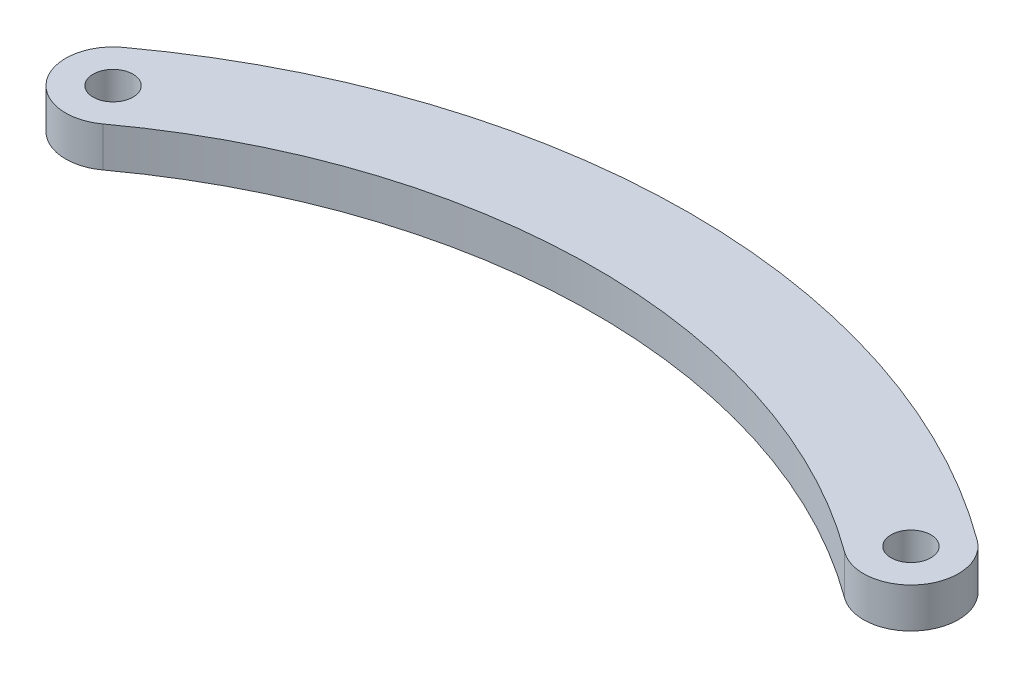
ISO-10303-21;
HEADER;
FILE_DESCRIPTION(('STEP AP214'),'2;1');
FILE_NAME('part.step','',(''),(''),'','','');
FILE_SCHEMA(('AUTOMOTIVE_DESIGN { 1 0 10303 214 1 1 1 1 }'));
ENDSEC;
DATA;
#1=APPLICATION_CONTEXT('core data for automotive mechanical design processes');
#2=APPLICATION_PROTOCOL_DEFINITION('international standard','automotive_design',2000,#1);
#3=PRODUCT_CONTEXT('',#1,'mechanical');
#4=PRODUCT('Part','Part','',(#3));
#5=PRODUCT_RELATED_PRODUCT_CATEGORY('part','',(#4));
#6=PRODUCT_DEFINITION_FORMATION('','',#4);
#7=PRODUCT_DEFINITION_CONTEXT('part definition',#1,'design');
#8=PRODUCT_DEFINITION('design','',#6,#7);
#9=PRODUCT_DEFINITION_SHAPE('','',#8);
#10=(LENGTH_UNIT() NAMED_UNIT(*) SI_UNIT(.MILLI.,.METRE.));
#11=(NAMED_UNIT(*) PLANE_ANGLE_UNIT() SI_UNIT($,.RADIAN.));
#12=(NAMED_UNIT(*) SI_UNIT($,.STERADIAN.) SOLID_ANGLE_UNIT());
#13=UNCERTAINTY_MEASURE_WITH_UNIT(LENGTH_MEASURE(1.E-05),#10,'distance_accuracy_value','');
#14=(GEOMETRIC_REPRESENTATION_CONTEXT(3) GLOBAL_UNCERTAINTY_ASSIGNED_CONTEXT((#13)) GLOBAL_UNIT_ASSIGNED_CONTEXT((#10,
#11,#12)) REPRESENTATION_CONTEXT('',''));
#15=CARTESIAN_POINT('',(0.,0.,0.));
#16=DIRECTION('',(0.,0.,1.));
#17=DIRECTION('',(1.,0.,0.));
#18=AXIS2_PLACEMENT_3D('',#15,#16,#17);
#19=CARTESIAN_POINT('',(34.1076732673267,3.175,2.20049504950495));
#20=DIRECTION('',(0.,-1.,0.));
#21=DIRECTION('',(0.,0.,-1.));
#22=AXIS2_PLACEMENT_3D('',#19,#20,#21);
#23=CYLINDRICAL_SURFACE('',#22,3.7750753482406);
#24=CARTESIAN_POINT('',(34.1076732673267,0.,2.20049504950495));
#25=DIRECTION('',(0.,1.,0.));
#26=DIRECTION('',(0.,0.,1.));
#27=AXIS2_PLACEMENT_3D('',#24,#25,#26);
#28=CIRCLE('',#27,3.7750753482406);
#29=CARTESIAN_POINT('',(31.875510339847,0.,5.24493958834597));
#30=VERTEX_POINT('',#29);
#31=CARTESIAN_POINT('',(36.3398361948065,0.,-0.843949489336048));
#32=VERTEX_POINT('',#31);
#33=EDGE_CURVE('E96',#30,#32,#28,.T.);
#34=ORIENTED_EDGE('',*,*,#33,.T.);
#35=DIRECTION('',(0.,-1.,0.));
#36=VECTOR('',#35,1.);
#37=CARTESIAN_POINT('',(36.3398361948065,3.175,-0.843949489336048));
#38=LINE('',#37,#36);
#39=CARTESIAN_POINT('',(36.3398361948065,3.175,-0.843949489336048));
#40=VERTEX_POINT('',#39);
#41=EDGE_CURVE('E11',#40,#32,#38,.T.);
#42=ORIENTED_EDGE('',*,*,#41,.F.);
#43=CARTESIAN_POINT('',(34.1076732673267,3.175,2.20049504950495));
#44=DIRECTION('',(0.,1.,0.));
#45=DIRECTION('',(0.,0.,1.));
#46=AXIS2_PLACEMENT_3D('',#43,#44,#45);
#47=CIRCLE('',#46,3.7750753482406);
#48=CARTESIAN_POINT('',(31.875510339847,3.175,5.24493958834597));
#49=VERTEX_POINT('',#48);
#50=EDGE_CURVE('E84',#49,#40,#47,.T.);
#51=ORIENTED_EDGE('',*,*,#50,.F.);
#52=DIRECTION('',(0.,-1.,0.));
#53=VECTOR('',#52,1.);
#54=CARTESIAN_POINT('',(31.875510339847,3.175,5.24493958834597));
#55=LINE('',#54,#53);
#56=EDGE_CURVE('E92',#49,#30,#55,.T.);
#57=ORIENTED_EDGE('',*,*,#56,.T.);
#58=EDGE_LOOP('',(#34,#42,#51,#57));
#59=FACE_BOUND('',#58,.T.);
#60=ADVANCED_FACE('F33',(#59),#23,.T.);
#61=CARTESIAN_POINT('',(2.35767326732675,3.175,45.5042848034804));
#62=DIRECTION('',(0.,-1.,0.));
#63=DIRECTION('',(0.,0.,-1.));
#64=AXIS2_PLACEMENT_3D('',#61,#62,#63);
#65=CYLINDRICAL_SURFACE('',#64,57.4712642917449);
#66=CARTESIAN_POINT('',(2.35767326732675,0.,45.5042848034804));
#67=DIRECTION('',(0.,1.,0.));
#68=DIRECTION('',(0.,0.,1.));
#69=AXIS2_PLACEMENT_3D('',#66,#67,#68);
#70=CIRCLE('',#69,57.4712642917449);
#71=CARTESIAN_POINT('',(-31.624489660153,0.,-0.843949489336075));
#72=VERTEX_POINT('',#71);
#73=EDGE_CURVE('E88',#32,#72,#70,.T.);
#74=ORIENTED_EDGE('',*,*,#73,.T.);
#75=DIRECTION('',(0.,-1.,0.));
#76=VECTOR('',#75,1.);
#77=CARTESIAN_POINT('',(-31.624489660153,3.175,-0.843949489336075));
#78=LINE('',#77,#76);
#79=CARTESIAN_POINT('',(-31.624489660153,3.175,-0.843949489336075));
#80=VERTEX_POINT('',#79);
#81=EDGE_CURVE('E41',#80,#72,#78,.T.);
#82=ORIENTED_EDGE('',*,*,#81,.F.);
#83=CARTESIAN_POINT('',(2.35767326732675,3.175,45.5042848034804));
#84=DIRECTION('',(0.,1.,0.));
#85=DIRECTION('',(0.,0.,1.));
#86=AXIS2_PLACEMENT_3D('',#83,#84,#85);
#87=CIRCLE('',#86,57.4712642917449);
#88=EDGE_CURVE('E79',#40,#80,#87,.T.);
#89=ORIENTED_EDGE('',*,*,#88,.F.);
#90=ORIENTED_EDGE('',*,*,#41,.T.);
#91=EDGE_LOOP('',(#74,#82,#89,#90));
#92=FACE_BOUND('',#91,.T.);
#93=ADVANCED_FACE('F87',(#92),#65,.T.);
#94=CARTESIAN_POINT('',(-29.3923267326733,3.175,2.20049504950495));
#95=DIRECTION('',(0.,-1.,0.));
#96=DIRECTION('',(0.,0.,-1.));
#97=AXIS2_PLACEMENT_3D('',#94,#95,#96);
#98=CYLINDRICAL_SURFACE('',#97,3.7750753482406);
#99=CARTESIAN_POINT('',(-29.3923267326733,0.,2.20049504950495));
#100=DIRECTION('',(0.,1.,0.));
#101=DIRECTION('',(0.,0.,1.));
#102=AXIS2_PLACEMENT_3D('',#99,#100,#101);
#103=CIRCLE('',#102,3.7750753482406);
#104=CARTESIAN_POINT('',(-27.1601638051935,0.,5.24493958834595));
#105=VERTEX_POINT('',#104);
#106=EDGE_CURVE('E66',#72,#105,#103,.T.);
#107=ORIENTED_EDGE('',*,*,#106,.T.);
#108=DIRECTION('',(0.,-1.,0.));
#109=VECTOR('',#108,1.);
#110=CARTESIAN_POINT('',(-27.1601638051935,3.175,5.24493958834595));
#111=LINE('',#110,#109);
#112=CARTESIAN_POINT('',(-27.1601638051935,3.175,5.24493958834595));
#113=VERTEX_POINT('',#112);
#114=EDGE_CURVE('E89',#113,#105,#111,.T.);
#115=ORIENTED_EDGE('',*,*,#114,.F.);
#116=CARTESIAN_POINT('',(-29.3923267326733,3.175,2.20049504950495));
#117=DIRECTION('',(0.,1.,0.));
#118=DIRECTION('',(0.,0.,1.));
#119=AXIS2_PLACEMENT_3D('',#116,#117,#118);
#120=CIRCLE('',#119,3.7750753482406);
#121=EDGE_CURVE('E82',#80,#113,#120,.T.);
#122=ORIENTED_EDGE('',*,*,#121,.F.);
#123=ORIENTED_EDGE('',*,*,#81,.T.);
#124=EDGE_LOOP('',(#107,#115,#122,#123));
#125=FACE_BOUND('',#124,.T.);
#126=ADVANCED_FACE('F90',(#125),#98,.T.);
#127=CARTESIAN_POINT('',(2.35767326732675,3.175,45.5042848034804));
#128=DIRECTION('',(0.,-1.,0.));
#129=DIRECTION('',(0.,0.,-1.));
#130=AXIS2_PLACEMENT_3D('',#127,#128,#129);
#131=CYLINDRICAL_SURFACE('',#130,49.9211135952637);
#132=CARTESIAN_POINT('',(2.35767326732675,0.,45.5042848034804));
#133=DIRECTION('',(0.,-1.,0.));
#134=DIRECTION('',(0.,0.,1.));
#135=AXIS2_PLACEMENT_3D('',#132,#133,#134);
#136=CIRCLE('',#135,49.9211135952637);
#137=EDGE_CURVE('E72',#105,#30,#136,.T.);
#138=ORIENTED_EDGE('',*,*,#137,.T.);
#139=ORIENTED_EDGE('',*,*,#56,.F.);
#140=CARTESIAN_POINT('',(2.35767326732675,3.175,45.5042848034804));
#141=DIRECTION('',(0.,-1.,0.));
#142=DIRECTION('',(0.,0.,1.));
#143=AXIS2_PLACEMENT_3D('',#140,#141,#142);
#144=CIRCLE('',#143,49.9211135952637);
#145=EDGE_CURVE('E49',#113,#49,#144,.T.);
#146=ORIENTED_EDGE('',*,*,#145,.F.);
#147=ORIENTED_EDGE('',*,*,#114,.T.);
#148=EDGE_LOOP('',(#138,#139,#146,#147));
#149=FACE_BOUND('',#148,.T.);
#150=ADVANCED_FACE('F104',(#149),#131,.F.);
#151=CARTESIAN_POINT('',(18.2326732673267,3.175,23.8523899264927));
#152=DIRECTION('',(0.,1.,0.));
#153=DIRECTION('',(0.,0.,1.));
#154=AXIS2_PLACEMENT_3D('',#151,#152,#153);
#155=PLANE('',#154);
#156=CARTESIAN_POINT('',(34.1076732673267,3.175,2.20049504950495));
#157=DIRECTION('',(0.,1.,0.));
#158=DIRECTION('',(0.,0.,1.));
#159=AXIS2_PLACEMENT_3D('',#156,#157,#158);
#160=CIRCLE('',#159,1.5875);
#161=CARTESIAN_POINT('',(34.1076732673267,3.175,3.78799504950495));
#162=VERTEX_POINT('',#161);
#163=EDGE_CURVE('E116',#162,#162,#160,.T.);
#164=ORIENTED_EDGE('',*,*,#163,.F.);
#165=EDGE_LOOP('',(#164));
#166=FACE_BOUND('',#165,.T.);
#167=CARTESIAN_POINT('',(-29.3923267326733,3.175,2.20049504950495));
#168=DIRECTION('',(0.,1.,0.));
#169=DIRECTION('',(0.,0.,1.));
#170=AXIS2_PLACEMENT_3D('',#167,#168,#169);
#171=CIRCLE('',#170,1.5875);
#172=CARTESIAN_POINT('',(-29.3923267326733,3.175,3.78799504950494));
#173=VERTEX_POINT('',#172);
#174=EDGE_CURVE('E110',#173,#173,#171,.T.);
#175=ORIENTED_EDGE('',*,*,#174,.F.);
#176=EDGE_LOOP('',(#175));
#177=FACE_BOUND('',#176,.T.);
#178=ORIENTED_EDGE('',*,*,#50,.T.);
#179=ORIENTED_EDGE('',*,*,#88,.T.);
#180=ORIENTED_EDGE('',*,*,#121,.T.);
#181=ORIENTED_EDGE('',*,*,#145,.T.);
#182=EDGE_LOOP('',(#178,#179,#180,#181));
#183=FACE_BOUND('',#182,.T.);
#184=ADVANCED_FACE('F80',(#166,#177,#183),#155,.T.);
#185=CARTESIAN_POINT('',(18.2326732673267,0.,23.8523899264927));
#186=DIRECTION('',(0.,1.,0.));
#187=DIRECTION('',(0.,0.,1.));
#188=AXIS2_PLACEMENT_3D('',#185,#186,#187);
#189=PLANE('',#188);
#190=CARTESIAN_POINT('',(34.1076732673267,0.,2.20049504950495));
#191=DIRECTION('',(0.,1.,0.));
#192=DIRECTION('',(0.,0.,1.));
#193=AXIS2_PLACEMENT_3D('',#190,#191,#192);
#194=CIRCLE('',#193,1.5875);
#195=CARTESIAN_POINT('',(34.1076732673267,0.,3.78799504950495));
#196=VERTEX_POINT('',#195);
#197=EDGE_CURVE('E113',#196,#196,#194,.T.);
#198=ORIENTED_EDGE('',*,*,#197,.T.);
#199=EDGE_LOOP('',(#198));
#200=FACE_BOUND('',#199,.T.);
#201=CARTESIAN_POINT('',(-29.3923267326733,0.,2.20049504950495));
#202=DIRECTION('',(0.,1.,0.));
#203=DIRECTION('',(0.,0.,1.));
#204=AXIS2_PLACEMENT_3D('',#201,#202,#203);
#205=CIRCLE('',#204,1.5875);
#206=CARTESIAN_POINT('',(-29.3923267326733,0.,3.78799504950494));
#207=VERTEX_POINT('',#206);
#208=EDGE_CURVE('E99',#207,#207,#205,.T.);
#209=ORIENTED_EDGE('',*,*,#208,.T.);
#210=EDGE_LOOP('',(#209));
#211=FACE_BOUND('',#210,.T.);
#212=ORIENTED_EDGE('',*,*,#33,.F.);
#213=ORIENTED_EDGE('',*,*,#137,.F.);
#214=ORIENTED_EDGE('',*,*,#106,.F.);
#215=ORIENTED_EDGE('',*,*,#73,.F.);
#216=EDGE_LOOP('',(#212,#213,#214,#215));
#217=FACE_BOUND('',#216,.T.);
#218=ADVANCED_FACE('F107',(#200,#211,#217),#189,.F.);
#219=CARTESIAN_POINT('',(-29.3923267326733,0.,2.20049504950495));
#220=DIRECTION('',(0.,1.,0.));
#221=DIRECTION('',(0.,0.,1.));
#222=AXIS2_PLACEMENT_3D('',#219,#220,#221);
#223=CYLINDRICAL_SURFACE('',#222,1.5875);
#224=ORIENTED_EDGE('',*,*,#208,.F.);
#225=EDGE_LOOP('',(#224));
#226=FACE_BOUND('',#225,.T.);
#227=ORIENTED_EDGE('',*,*,#174,.T.);
#228=EDGE_LOOP('',(#227));
#229=FACE_BOUND('',#228,.T.);
#230=ADVANCED_FACE('F127',(#226,#229),#223,.F.);
#231=CARTESIAN_POINT('',(34.1076732673267,0.,2.20049504950495));
#232=DIRECTION('',(0.,1.,0.));
#233=DIRECTION('',(0.,0.,1.));
#234=AXIS2_PLACEMENT_3D('',#231,#232,#233);
#235=CYLINDRICAL_SURFACE('',#234,1.5875);
#236=ORIENTED_EDGE('',*,*,#197,.F.);
#237=EDGE_LOOP('',(#236));
#238=FACE_BOUND('',#237,.T.);
#239=ORIENTED_EDGE('',*,*,#163,.T.);
#240=EDGE_LOOP('',(#239));
#241=FACE_BOUND('',#240,.T.);
#242=ADVANCED_FACE('F124',(#238,#241),#235,.F.);
#243=CLOSED_SHELL('',(#60,#93,#126,#150,#184,#218,#230,#242));
#244=MANIFOLD_SOLID_BREP('B2',#243);
#245=ADVANCED_BREP_SHAPE_REPRESENTATION('',(#18,#244),#14);
#246=SHAPE_DEFINITION_REPRESENTATION(#9,#245);
ENDSEC;
END-ISO-10303-21;
